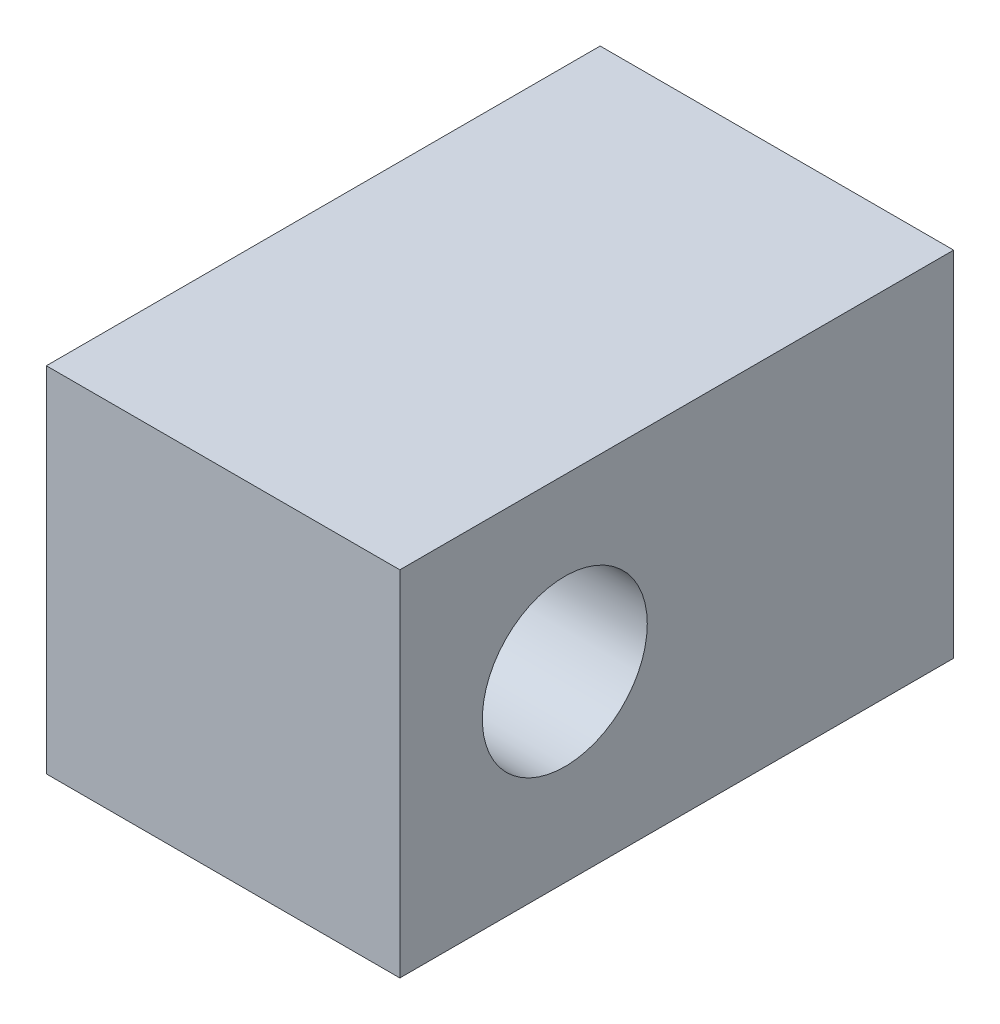
ISO-10303-21;
HEADER;
FILE_DESCRIPTION(('STEP AP214'),'2;1');
FILE_NAME('part.step','',(''),(''),'','','');
FILE_SCHEMA(('AUTOMOTIVE_DESIGN { 1 0 10303 214 1 1 1 1 }'));
ENDSEC;
DATA;
#1=APPLICATION_CONTEXT('core data for automotive mechanical design processes');
#2=APPLICATION_PROTOCOL_DEFINITION('international standard','automotive_design',2000,#1);
#3=PRODUCT_CONTEXT('',#1,'mechanical');
#4=PRODUCT('Part','Part','',(#3));
#5=PRODUCT_RELATED_PRODUCT_CATEGORY('part','',(#4));
#6=PRODUCT_DEFINITION_FORMATION('','',#4);
#7=PRODUCT_DEFINITION_CONTEXT('part definition',#1,'design');
#8=PRODUCT_DEFINITION('design','',#6,#7);
#9=PRODUCT_DEFINITION_SHAPE('','',#8);
#10=(LENGTH_UNIT() NAMED_UNIT(*) SI_UNIT(.MILLI.,.METRE.));
#11=(NAMED_UNIT(*) PLANE_ANGLE_UNIT() SI_UNIT($,.RADIAN.));
#12=(NAMED_UNIT(*) SI_UNIT($,.STERADIAN.) SOLID_ANGLE_UNIT());
#13=UNCERTAINTY_MEASURE_WITH_UNIT(LENGTH_MEASURE(1.E-05),#10,'distance_accuracy_value','');
#14=(GEOMETRIC_REPRESENTATION_CONTEXT(3) GLOBAL_UNCERTAINTY_ASSIGNED_CONTEXT((#13)) GLOBAL_UNIT_ASSIGNED_CONTEXT((#10,
#11,#12)) REPRESENTATION_CONTEXT('',''));
#15=CARTESIAN_POINT('',(0.,0.,0.));
#16=DIRECTION('',(0.,0.,1.));
#17=DIRECTION('',(1.,0.,0.));
#18=AXIS2_PLACEMENT_3D('',#15,#16,#17);
#19=CARTESIAN_POINT('',(-15.,-15.,47.));
#20=DIRECTION('',(1.,0.,0.));
#21=DIRECTION('',(0.,0.,-1.));
#22=AXIS2_PLACEMENT_3D('',#19,#20,#21);
#23=PLANE('',#22);
#24=CARTESIAN_POINT('',(-15.,0.525821826072138,33.));
#25=DIRECTION('',(1.,0.,0.));
#26=DIRECTION('',(0.,0.,-1.));
#27=AXIS2_PLACEMENT_3D('',#24,#25,#26);
#28=CIRCLE('',#27,7.);
#29=CARTESIAN_POINT('',(-15.,0.525821826072138,26.));
#30=VERTEX_POINT('',#29);
#31=EDGE_CURVE('E110',#30,#30,#28,.T.);
#32=ORIENTED_EDGE('',*,*,#31,.T.);
#33=EDGE_LOOP('',(#32));
#34=FACE_BOUND('',#33,.T.);
#35=DIRECTION('',(0.,-1.,0.));
#36=VECTOR('',#35,1.);
#37=CARTESIAN_POINT('',(-15.,-15.,0.));
#38=LINE('',#37,#36);
#39=CARTESIAN_POINT('',(-15.,15.,0.));
#40=VERTEX_POINT('',#39);
#41=CARTESIAN_POINT('',(-15.,-15.,0.));
#42=VERTEX_POINT('',#41);
#43=EDGE_CURVE('E106',#40,#42,#38,.T.);
#44=ORIENTED_EDGE('',*,*,#43,.T.);
#45=DIRECTION('',(0.,0.,-1.));
#46=VECTOR('',#45,1.);
#47=CARTESIAN_POINT('',(-15.,-15.,47.));
#48=LINE('',#47,#46);
#49=CARTESIAN_POINT('',(-15.,-15.,47.));
#50=VERTEX_POINT('',#49);
#51=EDGE_CURVE('E11',#50,#42,#48,.T.);
#52=ORIENTED_EDGE('',*,*,#51,.F.);
#53=DIRECTION('',(0.,-1.,0.));
#54=VECTOR('',#53,1.);
#55=CARTESIAN_POINT('',(-15.,-15.,47.));
#56=LINE('',#55,#54);
#57=CARTESIAN_POINT('',(-15.,15.,47.));
#58=VERTEX_POINT('',#57);
#59=EDGE_CURVE('E90',#58,#50,#56,.T.);
#60=ORIENTED_EDGE('',*,*,#59,.F.);
#61=DIRECTION('',(0.,0.,-1.));
#62=VECTOR('',#61,1.);
#63=CARTESIAN_POINT('',(-15.,15.,47.));
#64=LINE('',#63,#62);
#65=EDGE_CURVE('E102',#58,#40,#64,.T.);
#66=ORIENTED_EDGE('',*,*,#65,.T.);
#67=EDGE_LOOP('',(#44,#52,#60,#66));
#68=FACE_BOUND('',#67,.T.);
#69=ADVANCED_FACE('F38',(#34,#68),#23,.F.);
#70=CARTESIAN_POINT('',(15.,-15.,47.));
#71=DIRECTION('',(0.,1.,0.));
#72=DIRECTION('',(-1.,0.,0.));
#73=AXIS2_PLACEMENT_3D('',#70,#71,#72);
#74=PLANE('',#73);
#75=DIRECTION('',(1.,0.,0.));
#76=VECTOR('',#75,1.);
#77=CARTESIAN_POINT('',(15.,-15.,0.));
#78=LINE('',#77,#76);
#79=CARTESIAN_POINT('',(15.,-15.,0.));
#80=VERTEX_POINT('',#79);
#81=EDGE_CURVE('E95',#42,#80,#78,.T.);
#82=ORIENTED_EDGE('',*,*,#81,.T.);
#83=DIRECTION('',(0.,0.,-1.));
#84=VECTOR('',#83,1.);
#85=CARTESIAN_POINT('',(15.,-15.,47.));
#86=LINE('',#85,#84);
#87=CARTESIAN_POINT('',(15.,-15.,47.));
#88=VERTEX_POINT('',#87);
#89=EDGE_CURVE('E47',#88,#80,#86,.T.);
#90=ORIENTED_EDGE('',*,*,#89,.F.);
#91=DIRECTION('',(1.,0.,0.));
#92=VECTOR('',#91,1.);
#93=CARTESIAN_POINT('',(15.,-15.,47.));
#94=LINE('',#93,#92);
#95=EDGE_CURVE('E85',#50,#88,#94,.T.);
#96=ORIENTED_EDGE('',*,*,#95,.F.);
#97=ORIENTED_EDGE('',*,*,#51,.T.);
#98=EDGE_LOOP('',(#82,#90,#96,#97));
#99=FACE_BOUND('',#98,.T.);
#100=ADVANCED_FACE('F94',(#99),#74,.F.);
#101=CARTESIAN_POINT('',(15.,-15.,47.));
#102=DIRECTION('',(-1.,0.,0.));
#103=DIRECTION('',(0.,0.,1.));
#104=AXIS2_PLACEMENT_3D('',#101,#102,#103);
#105=PLANE('',#104);
#106=CARTESIAN_POINT('',(15.,0.525821826072138,33.));
#107=DIRECTION('',(1.,0.,0.));
#108=DIRECTION('',(0.,0.,-1.));
#109=AXIS2_PLACEMENT_3D('',#106,#107,#108);
#110=CIRCLE('',#109,7.);
#111=CARTESIAN_POINT('',(15.,0.525821826072138,26.));
#112=VERTEX_POINT('',#111);
#113=EDGE_CURVE('E130',#112,#112,#110,.T.);
#114=ORIENTED_EDGE('',*,*,#113,.F.);
#115=EDGE_LOOP('',(#114));
#116=FACE_BOUND('',#115,.T.);
#117=DIRECTION('',(0.,1.,0.));
#118=VECTOR('',#117,1.);
#119=CARTESIAN_POINT('',(15.,-15.,0.));
#120=LINE('',#119,#118);
#121=CARTESIAN_POINT('',(15.,15.,0.));
#122=VERTEX_POINT('',#121);
#123=EDGE_CURVE('E72',#80,#122,#120,.T.);
#124=ORIENTED_EDGE('',*,*,#123,.T.);
#125=DIRECTION('',(0.,0.,-1.));
#126=VECTOR('',#125,1.);
#127=CARTESIAN_POINT('',(15.,15.,47.));
#128=LINE('',#127,#126);
#129=CARTESIAN_POINT('',(15.,15.,47.));
#130=VERTEX_POINT('',#129);
#131=EDGE_CURVE('E97',#130,#122,#128,.T.);
#132=ORIENTED_EDGE('',*,*,#131,.F.);
#133=DIRECTION('',(0.,1.,0.));
#134=VECTOR('',#133,1.);
#135=CARTESIAN_POINT('',(15.,-15.,47.));
#136=LINE('',#135,#134);
#137=EDGE_CURVE('E88',#88,#130,#136,.T.);
#138=ORIENTED_EDGE('',*,*,#137,.F.);
#139=ORIENTED_EDGE('',*,*,#89,.T.);
#140=EDGE_LOOP('',(#124,#132,#138,#139));
#141=FACE_BOUND('',#140,.T.);
#142=ADVANCED_FACE('F98',(#116,#141),#105,.F.);
#143=CARTESIAN_POINT('',(15.,15.,47.));
#144=DIRECTION('',(0.,-1.,0.));
#145=DIRECTION('',(1.,0.,0.));
#146=AXIS2_PLACEMENT_3D('',#143,#144,#145);
#147=PLANE('',#146);
#148=DIRECTION('',(-1.,0.,0.));
#149=VECTOR('',#148,1.);
#150=CARTESIAN_POINT('',(15.,15.,0.));
#151=LINE('',#150,#149);
#152=EDGE_CURVE('E78',#122,#40,#151,.T.);
#153=ORIENTED_EDGE('',*,*,#152,.T.);
#154=ORIENTED_EDGE('',*,*,#65,.F.);
#155=DIRECTION('',(-1.,0.,0.));
#156=VECTOR('',#155,1.);
#157=CARTESIAN_POINT('',(15.,15.,47.));
#158=LINE('',#157,#156);
#159=EDGE_CURVE('E55',#130,#58,#158,.T.);
#160=ORIENTED_EDGE('',*,*,#159,.F.);
#161=ORIENTED_EDGE('',*,*,#131,.T.);
#162=EDGE_LOOP('',(#153,#154,#160,#161));
#163=FACE_BOUND('',#162,.T.);
#164=ADVANCED_FACE('F120',(#163),#147,.F.);
#165=CARTESIAN_POINT('',(0.,0.,47.));
#166=DIRECTION('',(0.,0.,1.));
#167=DIRECTION('',(1.,0.,0.));
#168=AXIS2_PLACEMENT_3D('',#165,#166,#167);
#169=PLANE('',#168);
#170=ORIENTED_EDGE('',*,*,#59,.T.);
#171=ORIENTED_EDGE('',*,*,#95,.T.);
#172=ORIENTED_EDGE('',*,*,#137,.T.);
#173=ORIENTED_EDGE('',*,*,#159,.T.);
#174=EDGE_LOOP('',(#170,#171,#172,#173));
#175=FACE_BOUND('',#174,.T.);
#176=ADVANCED_FACE('F86',(#175),#169,.T.);
#177=CARTESIAN_POINT('',(0.,0.,0.));
#178=DIRECTION('',(0.,0.,1.));
#179=DIRECTION('',(1.,0.,0.));
#180=AXIS2_PLACEMENT_3D('',#177,#178,#179);
#181=PLANE('',#180);
#182=ORIENTED_EDGE('',*,*,#43,.F.);
#183=ORIENTED_EDGE('',*,*,#152,.F.);
#184=ORIENTED_EDGE('',*,*,#123,.F.);
#185=ORIENTED_EDGE('',*,*,#81,.F.);
#186=EDGE_LOOP('',(#182,#183,#184,#185));
#187=FACE_BOUND('',#186,.T.);
#188=ADVANCED_FACE('F123',(#187),#181,.F.);
#189=CARTESIAN_POINT('',(-32.,0.525821826072138,33.));
#190=DIRECTION('',(1.,0.,0.));
#191=DIRECTION('',(0.,0.,-1.));
#192=AXIS2_PLACEMENT_3D('',#189,#190,#191);
#193=CYLINDRICAL_SURFACE('',#192,7.);
#194=ORIENTED_EDGE('',*,*,#113,.T.);
#195=EDGE_LOOP('',(#194));
#196=FACE_BOUND('',#195,.T.);
#197=ORIENTED_EDGE('',*,*,#31,.F.);
#198=EDGE_LOOP('',(#197));
#199=FACE_BOUND('',#198,.T.);
#200=ADVANCED_FACE('F135',(#196,#199),#193,.F.);
#201=CLOSED_SHELL('',(#69,#100,#142,#164,#176,#188,#200));
#202=MANIFOLD_SOLID_BREP('B2',#201);
#203=ADVANCED_BREP_SHAPE_REPRESENTATION('',(#18,#202),#14);
#204=SHAPE_DEFINITION_REPRESENTATION(#9,#203);
ENDSEC;
END-ISO-10303-21;
